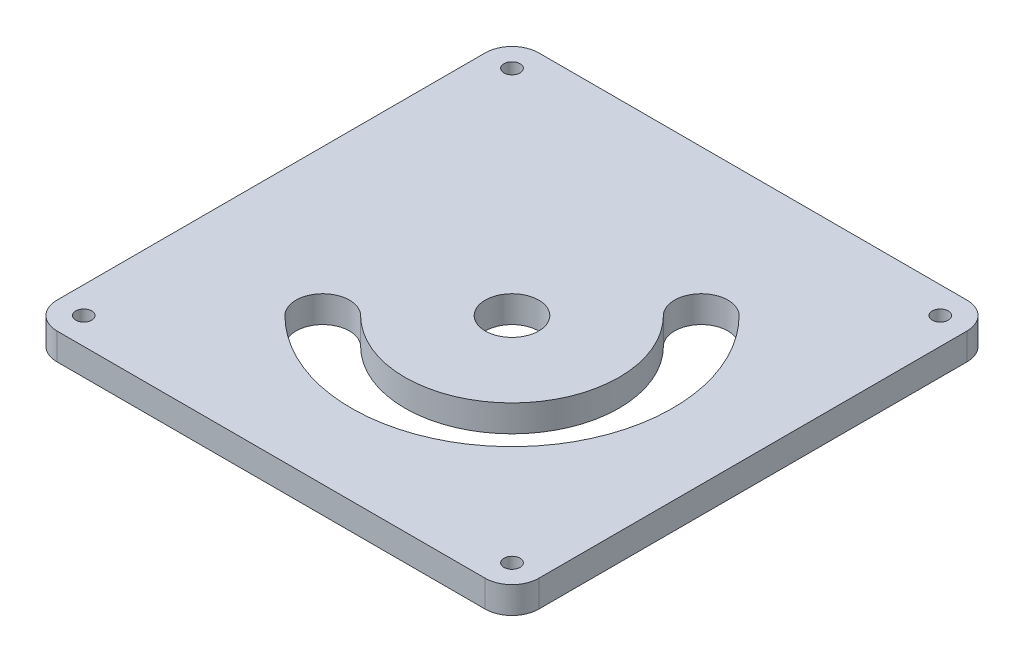
ISO-10303-21;
HEADER;
FILE_DESCRIPTION(('STEP AP214'),'2;1');
FILE_NAME('part.step','',(''),(''),'','','');
FILE_SCHEMA(('AUTOMOTIVE_DESIGN { 1 0 10303 214 1 1 1 1 }'));
ENDSEC;
DATA;
#1=APPLICATION_CONTEXT('core data for automotive mechanical design processes');
#2=APPLICATION_PROTOCOL_DEFINITION('international standard','automotive_design',2000,#1);
#3=PRODUCT_CONTEXT('',#1,'mechanical');
#4=PRODUCT('Part','Part','',(#3));
#5=PRODUCT_RELATED_PRODUCT_CATEGORY('part','',(#4));
#6=PRODUCT_DEFINITION_FORMATION('','',#4);
#7=PRODUCT_DEFINITION_CONTEXT('part definition',#1,'design');
#8=PRODUCT_DEFINITION('design','',#6,#7);
#9=PRODUCT_DEFINITION_SHAPE('','',#8);
#10=(LENGTH_UNIT() NAMED_UNIT(*) SI_UNIT(.MILLI.,.METRE.));
#11=(NAMED_UNIT(*) PLANE_ANGLE_UNIT() SI_UNIT($,.RADIAN.));
#12=(NAMED_UNIT(*) SI_UNIT($,.STERADIAN.) SOLID_ANGLE_UNIT());
#13=UNCERTAINTY_MEASURE_WITH_UNIT(LENGTH_MEASURE(1.E-05),#10,'distance_accuracy_value','');
#14=(GEOMETRIC_REPRESENTATION_CONTEXT(3) GLOBAL_UNCERTAINTY_ASSIGNED_CONTEXT((#13)) GLOBAL_UNIT_ASSIGNED_CONTEXT((#10,
#11,#12)) REPRESENTATION_CONTEXT('',''));
#15=CARTESIAN_POINT('',(0.,0.,0.));
#16=DIRECTION('',(0.,0.,1.));
#17=DIRECTION('',(1.,0.,0.));
#18=AXIS2_PLACEMENT_3D('',#15,#16,#17);
#19=CARTESIAN_POINT('',(0.,5.,0.));
#20=DIRECTION('',(0.,1.,0.));
#21=DIRECTION('',(0.,0.,1.));
#22=AXIS2_PLACEMENT_3D('',#19,#20,#21);
#23=PLANE('',#22);
#24=CARTESIAN_POINT('',(-40.,5.,40.));
#25=DIRECTION('',(0.,1.,0.));
#26=DIRECTION('',(0.,0.,1.));
#27=AXIS2_PLACEMENT_3D('',#24,#25,#26);
#28=CIRCLE('',#27,1.5);
#29=CARTESIAN_POINT('',(-40.,5.,41.5));
#30=VERTEX_POINT('',#29);
#31=EDGE_CURVE('E442',#30,#30,#28,.T.);
#32=ORIENTED_EDGE('',*,*,#31,.F.);
#33=EDGE_LOOP('',(#32));
#34=FACE_BOUND('',#33,.T.);
#35=CARTESIAN_POINT('',(40.,5.,40.));
#36=DIRECTION('',(0.,1.,0.));
#37=DIRECTION('',(0.,0.,1.));
#38=AXIS2_PLACEMENT_3D('',#35,#36,#37);
#39=CIRCLE('',#38,1.5);
#40=CARTESIAN_POINT('',(40.,5.,41.5));
#41=VERTEX_POINT('',#40);
#42=EDGE_CURVE('E434',#41,#41,#39,.T.);
#43=ORIENTED_EDGE('',*,*,#42,.F.);
#44=EDGE_LOOP('',(#43));
#45=FACE_BOUND('',#44,.T.);
#46=CARTESIAN_POINT('',(40.,5.,-40.));
#47=DIRECTION('',(0.,1.,0.));
#48=DIRECTION('',(0.,0.,1.));
#49=AXIS2_PLACEMENT_3D('',#46,#47,#48);
#50=CIRCLE('',#49,1.5);
#51=CARTESIAN_POINT('',(40.,5.,-38.5));
#52=VERTEX_POINT('',#51);
#53=EDGE_CURVE('E427',#52,#52,#50,.T.);
#54=ORIENTED_EDGE('',*,*,#53,.F.);
#55=EDGE_LOOP('',(#54));
#56=FACE_BOUND('',#55,.T.);
#57=CARTESIAN_POINT('',(-40.,5.,-40.));
#58=DIRECTION('',(0.,1.,0.));
#59=DIRECTION('',(0.,0.,1.));
#60=AXIS2_PLACEMENT_3D('',#57,#58,#59);
#61=CIRCLE('',#60,1.5);
#62=CARTESIAN_POINT('',(-40.,5.,-38.5));
#63=VERTEX_POINT('',#62);
#64=EDGE_CURVE('E431',#63,#63,#61,.T.);
#65=ORIENTED_EDGE('',*,*,#64,.F.);
#66=EDGE_LOOP('',(#65));
#67=FACE_BOUND('',#66,.T.);
#68=CARTESIAN_POINT('',(0.,5.,0.));
#69=DIRECTION('',(0.,1.,0.));
#70=DIRECTION('',(0.,0.,1.));
#71=AXIS2_PLACEMENT_3D('',#68,#69,#70);
#72=CIRCLE('',#71,30.);
#73=CARTESIAN_POINT('',(-21.2132034355964,5.,21.2132034355964));
#74=VERTEX_POINT('',#73);
#75=CARTESIAN_POINT('',(21.2132034355964,5.,-21.2132034355964));
#76=VERTEX_POINT('',#75);
#77=EDGE_CURVE('E135',#74,#76,#72,.T.);
#78=ORIENTED_EDGE('',*,*,#77,.F.);
#79=CARTESIAN_POINT('',(-17.6776695296637,5.,17.6776695296637));
#80=DIRECTION('',(0.,1.,0.));
#81=DIRECTION('',(0.,0.,1.));
#82=AXIS2_PLACEMENT_3D('',#79,#80,#81);
#83=CIRCLE('',#82,4.99999999999998);
#84=CARTESIAN_POINT('',(-14.1421356237309,5.,14.1421356237309));
#85=VERTEX_POINT('',#84);
#86=EDGE_CURVE('E125',#85,#74,#83,.T.);
#87=ORIENTED_EDGE('',*,*,#86,.F.);
#88=CARTESIAN_POINT('',(0.,5.,0.));
#89=DIRECTION('',(0.,-1.,0.));
#90=DIRECTION('',(0.,0.,1.));
#91=AXIS2_PLACEMENT_3D('',#88,#89,#90);
#92=CIRCLE('',#91,20.);
#93=CARTESIAN_POINT('',(14.1421356237309,5.,-14.1421356237309));
#94=VERTEX_POINT('',#93);
#95=EDGE_CURVE('E150',#94,#85,#92,.T.);
#96=ORIENTED_EDGE('',*,*,#95,.F.);
#97=CARTESIAN_POINT('',(17.6776695296637,5.,-17.6776695296637));
#98=DIRECTION('',(0.,1.,0.));
#99=DIRECTION('',(0.,0.,1.));
#100=AXIS2_PLACEMENT_3D('',#97,#98,#99);
#101=CIRCLE('',#100,4.99999999999999);
#102=EDGE_CURVE('E148',#76,#94,#101,.T.);
#103=ORIENTED_EDGE('',*,*,#102,.F.);
#104=EDGE_LOOP('',(#78,#87,#96,#103));
#105=FACE_BOUND('',#104,.T.);
#106=DIRECTION('',(0.,0.,1.));
#107=VECTOR('',#106,1.);
#108=CARTESIAN_POINT('',(-45.,5.,-45.));
#109=LINE('',#108,#107);
#110=CARTESIAN_POINT('',(-45.,5.,-40.));
#111=VERTEX_POINT('',#110);
#112=CARTESIAN_POINT('',(-45.,5.,40.));
#113=VERTEX_POINT('',#112);
#114=EDGE_CURVE('E173',#111,#113,#109,.T.);
#115=ORIENTED_EDGE('',*,*,#114,.T.);
#116=CARTESIAN_POINT('',(-40.,5.,40.));
#117=DIRECTION('',(0.,1.,0.));
#118=DIRECTION('',(0.,0.,1.));
#119=AXIS2_PLACEMENT_3D('',#116,#117,#118);
#120=CIRCLE('',#119,5.);
#121=CARTESIAN_POINT('',(-40.,5.,45.));
#122=VERTEX_POINT('',#121);
#123=EDGE_CURVE('E211',#113,#122,#120,.T.);
#124=ORIENTED_EDGE('',*,*,#123,.T.);
#125=DIRECTION('',(1.,0.,0.));
#126=VECTOR('',#125,1.);
#127=CARTESIAN_POINT('',(-45.,5.,45.));
#128=LINE('',#127,#126);
#129=CARTESIAN_POINT('',(40.,5.,45.));
#130=VERTEX_POINT('',#129);
#131=EDGE_CURVE('E176',#122,#130,#128,.T.);
#132=ORIENTED_EDGE('',*,*,#131,.T.);
#133=CARTESIAN_POINT('',(40.,5.,40.));
#134=DIRECTION('',(0.,1.,0.));
#135=DIRECTION('',(0.,0.,1.));
#136=AXIS2_PLACEMENT_3D('',#133,#134,#135);
#137=CIRCLE('',#136,5.);
#138=CARTESIAN_POINT('',(45.,5.,40.));
#139=VERTEX_POINT('',#138);
#140=EDGE_CURVE('E207',#130,#139,#137,.T.);
#141=ORIENTED_EDGE('',*,*,#140,.T.);
#142=DIRECTION('',(0.,0.,-1.));
#143=VECTOR('',#142,1.);
#144=CARTESIAN_POINT('',(45.,5.,-45.));
#145=LINE('',#144,#143);
#146=CARTESIAN_POINT('',(45.,5.,-40.));
#147=VERTEX_POINT('',#146);
#148=EDGE_CURVE('E168',#139,#147,#145,.T.);
#149=ORIENTED_EDGE('',*,*,#148,.T.);
#150=CARTESIAN_POINT('',(40.,5.,-40.));
#151=DIRECTION('',(0.,1.,0.));
#152=DIRECTION('',(0.,0.,1.));
#153=AXIS2_PLACEMENT_3D('',#150,#151,#152);
#154=CIRCLE('',#153,5.);
#155=CARTESIAN_POINT('',(40.,5.,-45.));
#156=VERTEX_POINT('',#155);
#157=EDGE_CURVE('E55',#147,#156,#154,.T.);
#158=ORIENTED_EDGE('',*,*,#157,.T.);
#159=DIRECTION('',(-1.,0.,0.));
#160=VECTOR('',#159,1.);
#161=CARTESIAN_POINT('',(-45.,5.,-45.));
#162=LINE('',#161,#160);
#163=CARTESIAN_POINT('',(-40.,5.,-45.));
#164=VERTEX_POINT('',#163);
#165=EDGE_CURVE('E170',#156,#164,#162,.T.);
#166=ORIENTED_EDGE('',*,*,#165,.T.);
#167=CARTESIAN_POINT('',(-40.,5.,-40.));
#168=DIRECTION('',(0.,1.,0.));
#169=DIRECTION('',(0.,0.,1.));
#170=AXIS2_PLACEMENT_3D('',#167,#168,#169);
#171=CIRCLE('',#170,5.);
#172=EDGE_CURVE('E209',#164,#111,#171,.T.);
#173=ORIENTED_EDGE('',*,*,#172,.T.);
#174=EDGE_LOOP('',(#115,#124,#132,#141,#149,#158,#166,#173));
#175=FACE_BOUND('',#174,.T.);
#176=CARTESIAN_POINT('',(0.,5.,0.));
#177=DIRECTION('',(0.,1.,0.));
#178=DIRECTION('',(0.,0.,1.));
#179=AXIS2_PLACEMENT_3D('',#176,#177,#178);
#180=CIRCLE('',#179,5.);
#181=CARTESIAN_POINT('',(0.,5.,5.));
#182=VERTEX_POINT('',#181);
#183=EDGE_CURVE('E157',#182,#182,#180,.T.);
#184=ORIENTED_EDGE('',*,*,#183,.F.);
#185=EDGE_LOOP('',(#184));
#186=FACE_BOUND('',#185,.T.);
#187=ADVANCED_FACE('F33',(#34,#45,#56,#67,#105,#175,#186),#23,.T.);
#188=CARTESIAN_POINT('',(0.,0.,0.));
#189=DIRECTION('',(0.,1.,0.));
#190=DIRECTION('',(0.,0.,1.));
#191=AXIS2_PLACEMENT_3D('',#188,#189,#190);
#192=PLANE('',#191);
#193=CARTESIAN_POINT('',(-40.,0.,40.));
#194=DIRECTION('',(0.,1.,0.));
#195=DIRECTION('',(0.,0.,1.));
#196=AXIS2_PLACEMENT_3D('',#193,#194,#195);
#197=CIRCLE('',#196,1.5);
#198=CARTESIAN_POINT('',(-40.,0.,41.5));
#199=VERTEX_POINT('',#198);
#200=EDGE_CURVE('E439',#199,#199,#197,.T.);
#201=ORIENTED_EDGE('',*,*,#200,.T.);
#202=EDGE_LOOP('',(#201));
#203=FACE_BOUND('',#202,.T.);
#204=CARTESIAN_POINT('',(40.,0.,40.));
#205=DIRECTION('',(0.,1.,0.));
#206=DIRECTION('',(0.,0.,1.));
#207=AXIS2_PLACEMENT_3D('',#204,#205,#206);
#208=CIRCLE('',#207,1.5);
#209=CARTESIAN_POINT('',(40.,0.,41.5));
#210=VERTEX_POINT('',#209);
#211=EDGE_CURVE('E429',#210,#210,#208,.T.);
#212=ORIENTED_EDGE('',*,*,#211,.T.);
#213=EDGE_LOOP('',(#212));
#214=FACE_BOUND('',#213,.T.);
#215=CARTESIAN_POINT('',(40.,0.,-40.));
#216=DIRECTION('',(0.,1.,0.));
#217=DIRECTION('',(0.,0.,1.));
#218=AXIS2_PLACEMENT_3D('',#215,#216,#217);
#219=CIRCLE('',#218,1.5);
#220=CARTESIAN_POINT('',(40.,0.,-38.5));
#221=VERTEX_POINT('',#220);
#222=EDGE_CURVE('E424',#221,#221,#219,.T.);
#223=ORIENTED_EDGE('',*,*,#222,.T.);
#224=EDGE_LOOP('',(#223));
#225=FACE_BOUND('',#224,.T.);
#226=CARTESIAN_POINT('',(-40.,0.,-40.));
#227=DIRECTION('',(0.,1.,0.));
#228=DIRECTION('',(0.,0.,1.));
#229=AXIS2_PLACEMENT_3D('',#226,#227,#228);
#230=CIRCLE('',#229,1.5);
#231=CARTESIAN_POINT('',(-40.,0.,-38.5));
#232=VERTEX_POINT('',#231);
#233=EDGE_CURVE('E445',#232,#232,#230,.T.);
#234=ORIENTED_EDGE('',*,*,#233,.T.);
#235=EDGE_LOOP('',(#234));
#236=FACE_BOUND('',#235,.T.);
#237=DIRECTION('',(1.,0.,0.));
#238=VECTOR('',#237,1.);
#239=CARTESIAN_POINT('',(-45.,0.,45.));
#240=LINE('',#239,#238);
#241=CARTESIAN_POINT('',(-40.,0.,45.));
#242=VERTEX_POINT('',#241);
#243=CARTESIAN_POINT('',(40.,0.,45.));
#244=VERTEX_POINT('',#243);
#245=EDGE_CURVE('E171',#242,#244,#240,.T.);
#246=ORIENTED_EDGE('',*,*,#245,.F.);
#247=CARTESIAN_POINT('',(-40.,0.,40.));
#248=DIRECTION('',(0.,1.,0.));
#249=DIRECTION('',(0.,0.,1.));
#250=AXIS2_PLACEMENT_3D('',#247,#248,#249);
#251=CIRCLE('',#250,5.);
#252=CARTESIAN_POINT('',(-45.,0.,40.));
#253=VERTEX_POINT('',#252);
#254=EDGE_CURVE('E199',#242,#253,#251,.F.);
#255=ORIENTED_EDGE('',*,*,#254,.T.);
#256=DIRECTION('',(0.,0.,1.));
#257=VECTOR('',#256,1.);
#258=CARTESIAN_POINT('',(-45.,0.,-45.));
#259=LINE('',#258,#257);
#260=CARTESIAN_POINT('',(-45.,0.,-40.));
#261=VERTEX_POINT('',#260);
#262=EDGE_CURVE('E184',#261,#253,#259,.T.);
#263=ORIENTED_EDGE('',*,*,#262,.F.);
#264=CARTESIAN_POINT('',(-40.,0.,-40.));
#265=DIRECTION('',(0.,1.,0.));
#266=DIRECTION('',(0.,0.,1.));
#267=AXIS2_PLACEMENT_3D('',#264,#265,#266);
#268=CIRCLE('',#267,5.);
#269=CARTESIAN_POINT('',(-40.,0.,-45.));
#270=VERTEX_POINT('',#269);
#271=EDGE_CURVE('E197',#261,#270,#268,.F.);
#272=ORIENTED_EDGE('',*,*,#271,.T.);
#273=DIRECTION('',(-1.,0.,0.));
#274=VECTOR('',#273,1.);
#275=CARTESIAN_POINT('',(-45.,0.,-45.));
#276=LINE('',#275,#274);
#277=CARTESIAN_POINT('',(40.,0.,-45.));
#278=VERTEX_POINT('',#277);
#279=EDGE_CURVE('E182',#278,#270,#276,.T.);
#280=ORIENTED_EDGE('',*,*,#279,.F.);
#281=CARTESIAN_POINT('',(40.,0.,-40.));
#282=DIRECTION('',(0.,1.,0.));
#283=DIRECTION('',(0.,0.,1.));
#284=AXIS2_PLACEMENT_3D('',#281,#282,#283);
#285=CIRCLE('',#284,5.);
#286=CARTESIAN_POINT('',(45.,0.,-40.));
#287=VERTEX_POINT('',#286);
#288=EDGE_CURVE('E193',#278,#287,#285,.F.);
#289=ORIENTED_EDGE('',*,*,#288,.T.);
#290=DIRECTION('',(0.,0.,-1.));
#291=VECTOR('',#290,1.);
#292=CARTESIAN_POINT('',(45.,0.,-45.));
#293=LINE('',#292,#291);
#294=CARTESIAN_POINT('',(45.,0.,40.));
#295=VERTEX_POINT('',#294);
#296=EDGE_CURVE('E143',#295,#287,#293,.T.);
#297=ORIENTED_EDGE('',*,*,#296,.F.);
#298=CARTESIAN_POINT('',(40.,0.,40.));
#299=DIRECTION('',(0.,1.,0.));
#300=DIRECTION('',(0.,0.,1.));
#301=AXIS2_PLACEMENT_3D('',#298,#299,#300);
#302=CIRCLE('',#301,5.);
#303=EDGE_CURVE('E195',#295,#244,#302,.F.);
#304=ORIENTED_EDGE('',*,*,#303,.T.);
#305=EDGE_LOOP('',(#246,#255,#263,#272,#280,#289,#297,#304));
#306=FACE_BOUND('',#305,.T.);
#307=CARTESIAN_POINT('',(-17.6776695296637,0.,17.6776695296637));
#308=DIRECTION('',(0.,1.,0.));
#309=DIRECTION('',(0.,0.,1.));
#310=AXIS2_PLACEMENT_3D('',#307,#308,#309);
#311=CIRCLE('',#310,4.99999999999998);
#312=CARTESIAN_POINT('',(-14.1421356237309,0.,14.1421356237309));
#313=VERTEX_POINT('',#312);
#314=CARTESIAN_POINT('',(-21.2132034355964,0.,21.2132034355964));
#315=VERTEX_POINT('',#314);
#316=EDGE_CURVE('E155',#313,#315,#311,.T.);
#317=ORIENTED_EDGE('',*,*,#316,.T.);
#318=CARTESIAN_POINT('',(0.,0.,0.));
#319=DIRECTION('',(0.,1.,0.));
#320=DIRECTION('',(0.,0.,1.));
#321=AXIS2_PLACEMENT_3D('',#318,#319,#320);
#322=CIRCLE('',#321,30.);
#323=CARTESIAN_POINT('',(21.2132034355964,0.,-21.2132034355964));
#324=VERTEX_POINT('',#323);
#325=EDGE_CURVE('E142',#315,#324,#322,.T.);
#326=ORIENTED_EDGE('',*,*,#325,.T.);
#327=CARTESIAN_POINT('',(17.6776695296637,0.,-17.6776695296637));
#328=DIRECTION('',(0.,1.,0.));
#329=DIRECTION('',(0.,0.,1.));
#330=AXIS2_PLACEMENT_3D('',#327,#328,#329);
#331=CIRCLE('',#330,4.99999999999999);
#332=CARTESIAN_POINT('',(14.142135623731,0.,-14.142135623731));
#333=VERTEX_POINT('',#332);
#334=EDGE_CURVE('E159',#324,#333,#331,.T.);
#335=ORIENTED_EDGE('',*,*,#334,.T.);
#336=CARTESIAN_POINT('',(0.,0.,0.));
#337=DIRECTION('',(0.,-1.,0.));
#338=DIRECTION('',(0.,0.,1.));
#339=AXIS2_PLACEMENT_3D('',#336,#337,#338);
#340=CIRCLE('',#339,20.);
#341=EDGE_CURVE('E136',#333,#313,#340,.T.);
#342=ORIENTED_EDGE('',*,*,#341,.T.);
#343=EDGE_LOOP('',(#317,#326,#335,#342));
#344=FACE_BOUND('',#343,.T.);
#345=CARTESIAN_POINT('',(0.,0.,0.));
#346=DIRECTION('',(0.,1.,0.));
#347=DIRECTION('',(0.,0.,1.));
#348=AXIS2_PLACEMENT_3D('',#345,#346,#347);
#349=CIRCLE('',#348,5.);
#350=CARTESIAN_POINT('',(0.,0.,5.));
#351=VERTEX_POINT('',#350);
#352=EDGE_CURVE('E448',#351,#351,#349,.T.);
#353=ORIENTED_EDGE('',*,*,#352,.T.);
#354=EDGE_LOOP('',(#353));
#355=FACE_BOUND('',#354,.T.);
#356=ADVANCED_FACE('F230',(#203,#214,#225,#236,#306,#344,#355),#192,.F.);
#357=CARTESIAN_POINT('',(45.,5.,-45.));
#358=DIRECTION('',(-1.,0.,0.));
#359=DIRECTION('',(0.,0.,1.));
#360=AXIS2_PLACEMENT_3D('',#357,#358,#359);
#361=PLANE('',#360);
#362=ORIENTED_EDGE('',*,*,#148,.F.);
#363=DIRECTION('',(0.,-1.,0.));
#364=VECTOR('',#363,1.);
#365=CARTESIAN_POINT('',(45.,5.,40.));
#366=LINE('',#365,#364);
#367=EDGE_CURVE('E11',#139,#295,#366,.T.);
#368=ORIENTED_EDGE('',*,*,#367,.T.);
#369=ORIENTED_EDGE('',*,*,#296,.T.);
#370=DIRECTION('',(0.,-1.,0.));
#371=VECTOR('',#370,1.);
#372=CARTESIAN_POINT('',(45.,5.,-40.));
#373=LINE('',#372,#371);
#374=EDGE_CURVE('E41',#287,#147,#373,.F.);
#375=ORIENTED_EDGE('',*,*,#374,.T.);
#376=EDGE_LOOP('',(#362,#368,#369,#375));
#377=FACE_BOUND('',#376,.T.);
#378=ADVANCED_FACE('F219',(#377),#361,.F.);
#379=CARTESIAN_POINT('',(-45.,5.,-45.));
#380=DIRECTION('',(0.,0.,1.));
#381=DIRECTION('',(1.,0.,0.));
#382=AXIS2_PLACEMENT_3D('',#379,#380,#381);
#383=PLANE('',#382);
#384=ORIENTED_EDGE('',*,*,#279,.T.);
#385=DIRECTION('',(0.,-1.,0.));
#386=VECTOR('',#385,1.);
#387=CARTESIAN_POINT('',(-40.,5.,-45.));
#388=LINE('',#387,#386);
#389=EDGE_CURVE('E48',#270,#164,#388,.F.);
#390=ORIENTED_EDGE('',*,*,#389,.T.);
#391=ORIENTED_EDGE('',*,*,#165,.F.);
#392=DIRECTION('',(0.,-1.,0.));
#393=VECTOR('',#392,1.);
#394=CARTESIAN_POINT('',(40.,5.,-45.));
#395=LINE('',#394,#393);
#396=EDGE_CURVE('E213',#156,#278,#395,.T.);
#397=ORIENTED_EDGE('',*,*,#396,.T.);
#398=EDGE_LOOP('',(#384,#390,#391,#397));
#399=FACE_BOUND('',#398,.T.);
#400=ADVANCED_FACE('F227',(#399),#383,.F.);
#401=CARTESIAN_POINT('',(-45.,5.,-45.));
#402=DIRECTION('',(1.,0.,0.));
#403=DIRECTION('',(0.,0.,-1.));
#404=AXIS2_PLACEMENT_3D('',#401,#402,#403);
#405=PLANE('',#404);
#406=ORIENTED_EDGE('',*,*,#262,.T.);
#407=DIRECTION('',(0.,-1.,0.));
#408=VECTOR('',#407,1.);
#409=CARTESIAN_POINT('',(-45.,5.,40.));
#410=LINE('',#409,#408);
#411=EDGE_CURVE('E204',#253,#113,#410,.F.);
#412=ORIENTED_EDGE('',*,*,#411,.T.);
#413=ORIENTED_EDGE('',*,*,#114,.F.);
#414=DIRECTION('',(0.,-1.,0.));
#415=VECTOR('',#414,1.);
#416=CARTESIAN_POINT('',(-45.,5.,-40.));
#417=LINE('',#416,#415);
#418=EDGE_CURVE('E201',#111,#261,#417,.T.);
#419=ORIENTED_EDGE('',*,*,#418,.T.);
#420=EDGE_LOOP('',(#406,#412,#413,#419));
#421=FACE_BOUND('',#420,.T.);
#422=ADVANCED_FACE('F239',(#421),#405,.F.);
#423=CARTESIAN_POINT('',(-45.,5.,45.));
#424=DIRECTION('',(0.,0.,-1.));
#425=DIRECTION('',(-1.,0.,0.));
#426=AXIS2_PLACEMENT_3D('',#423,#424,#425);
#427=PLANE('',#426);
#428=ORIENTED_EDGE('',*,*,#131,.F.);
#429=DIRECTION('',(0.,-1.,0.));
#430=VECTOR('',#429,1.);
#431=CARTESIAN_POINT('',(-40.,5.,45.));
#432=LINE('',#431,#430);
#433=EDGE_CURVE('E190',#122,#242,#432,.T.);
#434=ORIENTED_EDGE('',*,*,#433,.T.);
#435=ORIENTED_EDGE('',*,*,#245,.T.);
#436=DIRECTION('',(0.,-1.,0.));
#437=VECTOR('',#436,1.);
#438=CARTESIAN_POINT('',(40.,5.,45.));
#439=LINE('',#438,#437);
#440=EDGE_CURVE('E179',#244,#130,#439,.F.);
#441=ORIENTED_EDGE('',*,*,#440,.T.);
#442=EDGE_LOOP('',(#428,#434,#435,#441));
#443=FACE_BOUND('',#442,.T.);
#444=ADVANCED_FACE('F247',(#443),#427,.F.);
#445=CARTESIAN_POINT('',(-17.6776695296637,5.,17.6776695296637));
#446=DIRECTION('',(0.,-1.,0.));
#447=DIRECTION('',(0.,0.,-1.));
#448=AXIS2_PLACEMENT_3D('',#445,#446,#447);
#449=CYLINDRICAL_SURFACE('',#448,4.99999999999998);
#450=ORIENTED_EDGE('',*,*,#316,.F.);
#451=DIRECTION('',(0.,-1.,0.));
#452=VECTOR('',#451,1.);
#453=CARTESIAN_POINT('',(-14.1421356237309,5.,14.1421356237309));
#454=LINE('',#453,#452);
#455=EDGE_CURVE('E131',#85,#313,#454,.T.);
#456=ORIENTED_EDGE('',*,*,#455,.F.);
#457=ORIENTED_EDGE('',*,*,#86,.T.);
#458=DIRECTION('',(0.,-1.,0.));
#459=VECTOR('',#458,1.);
#460=CARTESIAN_POINT('',(-21.2132034355964,5.,21.2132034355964));
#461=LINE('',#460,#459);
#462=EDGE_CURVE('E128',#74,#315,#461,.T.);
#463=ORIENTED_EDGE('',*,*,#462,.T.);
#464=EDGE_LOOP('',(#450,#456,#457,#463));
#465=FACE_BOUND('',#464,.T.);
#466=ADVANCED_FACE('F127',(#465),#449,.F.);
#467=CARTESIAN_POINT('',(0.,5.,0.));
#468=DIRECTION('',(0.,-1.,0.));
#469=DIRECTION('',(0.,0.,-1.));
#470=AXIS2_PLACEMENT_3D('',#467,#468,#469);
#471=CYLINDRICAL_SURFACE('',#470,30.);
#472=ORIENTED_EDGE('',*,*,#325,.F.);
#473=ORIENTED_EDGE('',*,*,#462,.F.);
#474=ORIENTED_EDGE('',*,*,#77,.T.);
#475=DIRECTION('',(0.,-1.,0.));
#476=VECTOR('',#475,1.);
#477=CARTESIAN_POINT('',(21.2132034355964,5.,-21.2132034355964));
#478=LINE('',#477,#476);
#479=EDGE_CURVE('E144',#76,#324,#478,.T.);
#480=ORIENTED_EDGE('',*,*,#479,.T.);
#481=EDGE_LOOP('',(#472,#473,#474,#480));
#482=FACE_BOUND('',#481,.T.);
#483=ADVANCED_FACE('F139',(#482),#471,.F.);
#484=CARTESIAN_POINT('',(17.6776695296637,5.,-17.6776695296637));
#485=DIRECTION('',(0.,-1.,0.));
#486=DIRECTION('',(0.,0.,-1.));
#487=AXIS2_PLACEMENT_3D('',#484,#485,#486);
#488=CYLINDRICAL_SURFACE('',#487,4.99999999999999);
#489=ORIENTED_EDGE('',*,*,#334,.F.);
#490=ORIENTED_EDGE('',*,*,#479,.F.);
#491=ORIENTED_EDGE('',*,*,#102,.T.);
#492=DIRECTION('',(0.,-1.,0.));
#493=VECTOR('',#492,1.);
#494=CARTESIAN_POINT('',(14.142135623731,5.,-14.142135623731));
#495=LINE('',#494,#493);
#496=EDGE_CURVE('E165',#94,#333,#495,.T.);
#497=ORIENTED_EDGE('',*,*,#496,.T.);
#498=EDGE_LOOP('',(#489,#490,#491,#497));
#499=FACE_BOUND('',#498,.T.);
#500=ADVANCED_FACE('F307',(#499),#488,.F.);
#501=CARTESIAN_POINT('',(0.,5.,0.));
#502=DIRECTION('',(0.,-1.,0.));
#503=DIRECTION('',(0.,0.,-1.));
#504=AXIS2_PLACEMENT_3D('',#501,#502,#503);
#505=CYLINDRICAL_SURFACE('',#504,20.);
#506=ORIENTED_EDGE('',*,*,#341,.F.);
#507=ORIENTED_EDGE('',*,*,#496,.F.);
#508=ORIENTED_EDGE('',*,*,#95,.T.);
#509=ORIENTED_EDGE('',*,*,#455,.T.);
#510=EDGE_LOOP('',(#506,#507,#508,#509));
#511=FACE_BOUND('',#510,.T.);
#512=ADVANCED_FACE('F303',(#511),#505,.T.);
#513=CARTESIAN_POINT('',(0.,5.,0.));
#514=DIRECTION('',(0.,-1.,0.));
#515=DIRECTION('',(0.,0.,-1.));
#516=AXIS2_PLACEMENT_3D('',#513,#514,#515);
#517=CYLINDRICAL_SURFACE('',#516,5.);
#518=ORIENTED_EDGE('',*,*,#183,.T.);
#519=EDGE_LOOP('',(#518));
#520=FACE_BOUND('',#519,.T.);
#521=ORIENTED_EDGE('',*,*,#352,.F.);
#522=EDGE_LOOP('',(#521));
#523=FACE_BOUND('',#522,.T.);
#524=ADVANCED_FACE('F299',(#520,#523),#517,.F.);
#525=CARTESIAN_POINT('',(-40.,0.,-40.));
#526=DIRECTION('',(0.,1.,0.));
#527=DIRECTION('',(0.,0.,1.));
#528=AXIS2_PLACEMENT_3D('',#525,#526,#527);
#529=CYLINDRICAL_SURFACE('',#528,1.5);
#530=ORIENTED_EDGE('',*,*,#233,.F.);
#531=EDGE_LOOP('',(#530));
#532=FACE_BOUND('',#531,.T.);
#533=ORIENTED_EDGE('',*,*,#64,.T.);
#534=EDGE_LOOP('',(#533));
#535=FACE_BOUND('',#534,.T.);
#536=ADVANCED_FACE('F296',(#532,#535),#529,.F.);
#537=CARTESIAN_POINT('',(40.,0.,-40.));
#538=DIRECTION('',(0.,1.,0.));
#539=DIRECTION('',(0.,0.,1.));
#540=AXIS2_PLACEMENT_3D('',#537,#538,#539);
#541=CYLINDRICAL_SURFACE('',#540,1.5);
#542=ORIENTED_EDGE('',*,*,#222,.F.);
#543=EDGE_LOOP('',(#542));
#544=FACE_BOUND('',#543,.T.);
#545=ORIENTED_EDGE('',*,*,#53,.T.);
#546=EDGE_LOOP('',(#545));
#547=FACE_BOUND('',#546,.T.);
#548=ADVANCED_FACE('F289',(#544,#547),#541,.F.);
#549=CARTESIAN_POINT('',(40.,0.,40.));
#550=DIRECTION('',(0.,1.,0.));
#551=DIRECTION('',(0.,0.,1.));
#552=AXIS2_PLACEMENT_3D('',#549,#550,#551);
#553=CYLINDRICAL_SURFACE('',#552,1.5);
#554=ORIENTED_EDGE('',*,*,#211,.F.);
#555=EDGE_LOOP('',(#554));
#556=FACE_BOUND('',#555,.T.);
#557=ORIENTED_EDGE('',*,*,#42,.T.);
#558=EDGE_LOOP('',(#557));
#559=FACE_BOUND('',#558,.T.);
#560=ADVANCED_FACE('F284',(#556,#559),#553,.F.);
#561=CARTESIAN_POINT('',(-40.,0.,40.));
#562=DIRECTION('',(0.,1.,0.));
#563=DIRECTION('',(0.,0.,1.));
#564=AXIS2_PLACEMENT_3D('',#561,#562,#563);
#565=CYLINDRICAL_SURFACE('',#564,1.5);
#566=ORIENTED_EDGE('',*,*,#200,.F.);
#567=EDGE_LOOP('',(#566));
#568=FACE_BOUND('',#567,.T.);
#569=ORIENTED_EDGE('',*,*,#31,.T.);
#570=EDGE_LOOP('',(#569));
#571=FACE_BOUND('',#570,.T.);
#572=ADVANCED_FACE('F280',(#568,#571),#565,.F.);
#573=CARTESIAN_POINT('',(-40.,5.,40.));
#574=DIRECTION('',(0.,-1.,0.));
#575=DIRECTION('',(0.,0.,-1.));
#576=AXIS2_PLACEMENT_3D('',#573,#574,#575);
#577=CYLINDRICAL_SURFACE('',#576,5.);
#578=ORIENTED_EDGE('',*,*,#123,.F.);
#579=ORIENTED_EDGE('',*,*,#411,.F.);
#580=ORIENTED_EDGE('',*,*,#254,.F.);
#581=ORIENTED_EDGE('',*,*,#433,.F.);
#582=EDGE_LOOP('',(#578,#579,#580,#581));
#583=FACE_BOUND('',#582,.T.);
#584=ADVANCED_FACE('F245',(#583),#577,.T.);
#585=CARTESIAN_POINT('',(-40.,5.,-40.));
#586=DIRECTION('',(0.,-1.,0.));
#587=DIRECTION('',(0.,0.,-1.));
#588=AXIS2_PLACEMENT_3D('',#585,#586,#587);
#589=CYLINDRICAL_SURFACE('',#588,5.);
#590=ORIENTED_EDGE('',*,*,#172,.F.);
#591=ORIENTED_EDGE('',*,*,#389,.F.);
#592=ORIENTED_EDGE('',*,*,#271,.F.);
#593=ORIENTED_EDGE('',*,*,#418,.F.);
#594=EDGE_LOOP('',(#590,#591,#592,#593));
#595=FACE_BOUND('',#594,.T.);
#596=ADVANCED_FACE('F236',(#595),#589,.T.);
#597=CARTESIAN_POINT('',(40.,5.,40.));
#598=DIRECTION('',(0.,-1.,0.));
#599=DIRECTION('',(0.,0.,-1.));
#600=AXIS2_PLACEMENT_3D('',#597,#598,#599);
#601=CYLINDRICAL_SURFACE('',#600,5.);
#602=ORIENTED_EDGE('',*,*,#140,.F.);
#603=ORIENTED_EDGE('',*,*,#440,.F.);
#604=ORIENTED_EDGE('',*,*,#303,.F.);
#605=ORIENTED_EDGE('',*,*,#367,.F.);
#606=EDGE_LOOP('',(#602,#603,#604,#605));
#607=FACE_BOUND('',#606,.T.);
#608=ADVANCED_FACE('F250',(#607),#601,.T.);
#609=CARTESIAN_POINT('',(40.,5.,-40.));
#610=DIRECTION('',(0.,-1.,0.));
#611=DIRECTION('',(0.,0.,-1.));
#612=AXIS2_PLACEMENT_3D('',#609,#610,#611);
#613=CYLINDRICAL_SURFACE('',#612,5.);
#614=ORIENTED_EDGE('',*,*,#157,.F.);
#615=ORIENTED_EDGE('',*,*,#374,.F.);
#616=ORIENTED_EDGE('',*,*,#288,.F.);
#617=ORIENTED_EDGE('',*,*,#396,.F.);
#618=EDGE_LOOP('',(#614,#615,#616,#617));
#619=FACE_BOUND('',#618,.T.);
#620=ADVANCED_FACE('F35',(#619),#613,.T.);
#621=CLOSED_SHELL('',(#187,#356,#378,#400,#422,#444,#466,#483,#500,#512,#524,#536,#548,#560,
#572,#584,#596,#608,#620));
#622=MANIFOLD_SOLID_BREP('B2',#621);
#623=ADVANCED_BREP_SHAPE_REPRESENTATION('',(#18,#622),#14);
#624=SHAPE_DEFINITION_REPRESENTATION(#9,#623);
ENDSEC;
END-ISO-10303-21;
